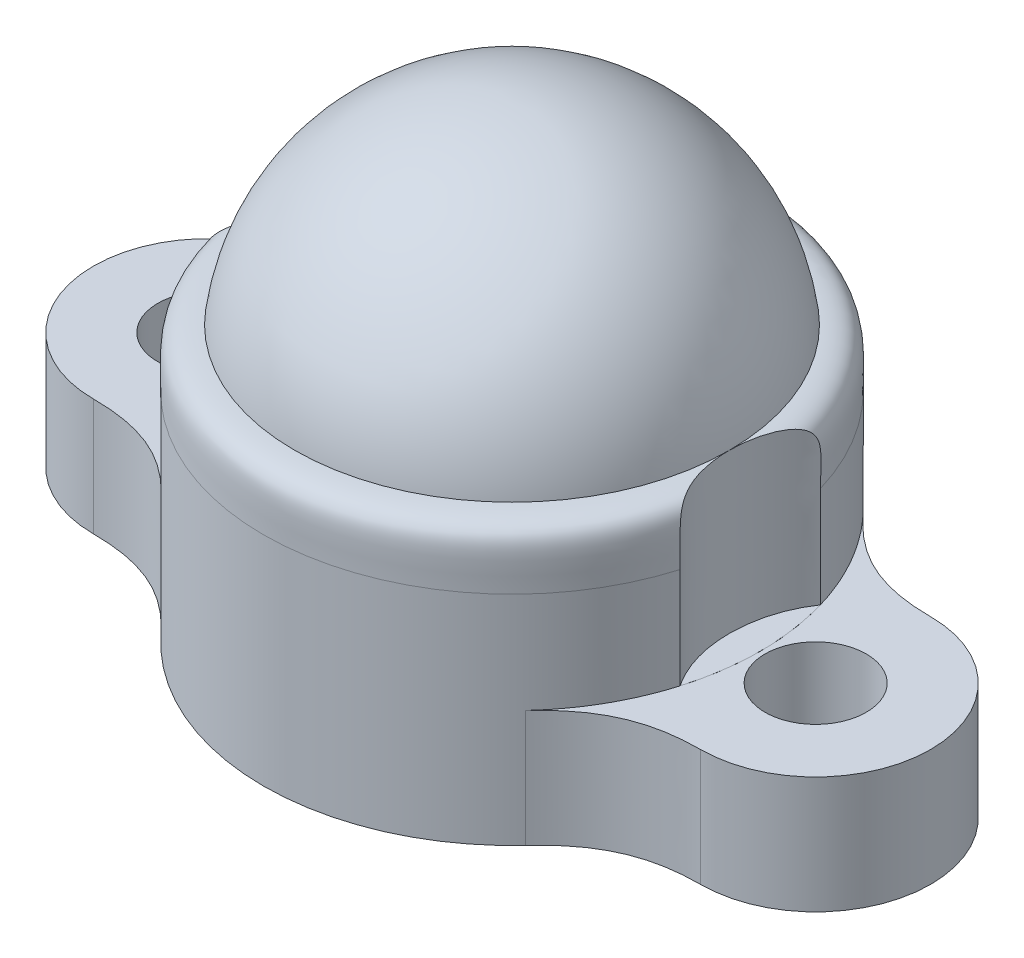
ISO-10303-21;
HEADER;
FILE_DESCRIPTION(('STEP AP214'),'2;1');
FILE_NAME('part.step','',(''),(''),'','','');
FILE_SCHEMA(('AUTOMOTIVE_DESIGN { 1 0 10303 214 1 1 1 1 }'));
ENDSEC;
DATA;
#1=APPLICATION_CONTEXT('core data for automotive mechanical design processes');
#2=APPLICATION_PROTOCOL_DEFINITION('international standard','automotive_design',2000,#1);
#3=PRODUCT_CONTEXT('',#1,'mechanical');
#4=PRODUCT('Part','Part','',(#3));
#5=PRODUCT_RELATED_PRODUCT_CATEGORY('part','',(#4));
#6=PRODUCT_DEFINITION_FORMATION('','',#4);
#7=PRODUCT_DEFINITION_CONTEXT('part definition',#1,'design');
#8=PRODUCT_DEFINITION('design','',#6,#7);
#9=PRODUCT_DEFINITION_SHAPE('','',#8);
#10=(LENGTH_UNIT() NAMED_UNIT(*) SI_UNIT(.MILLI.,.METRE.));
#11=(NAMED_UNIT(*) PLANE_ANGLE_UNIT() SI_UNIT($,.RADIAN.));
#12=(NAMED_UNIT(*) SI_UNIT($,.STERADIAN.) SOLID_ANGLE_UNIT());
#13=UNCERTAINTY_MEASURE_WITH_UNIT(LENGTH_MEASURE(1.E-05),#10,'distance_accuracy_value','');
#14=(GEOMETRIC_REPRESENTATION_CONTEXT(3) GLOBAL_UNCERTAINTY_ASSIGNED_CONTEXT((#13)) GLOBAL_UNIT_ASSIGNED_CONTEXT((#10,
#11,#12)) REPRESENTATION_CONTEXT('',''));
#15=CARTESIAN_POINT('',(0.,0.,0.));
#16=DIRECTION('',(0.,0.,1.));
#17=DIRECTION('',(1.,0.,0.));
#18=AXIS2_PLACEMENT_3D('',#15,#16,#17);
#19=CARTESIAN_POINT('',(6.6,-2.8575,-2.5));
#20=CARTESIAN_POINT('',(5.36231166563302,-2.8575,-2.5));
#21=CARTESIAN_POINT('',(4.63638579948082,-2.8575,-2.94110421368491));
#22=CARTESIAN_POINT('',(3.95984253467832,-2.8575,-3.67089941930334));
#23=B_SPLINE_CURVE_WITH_KNOTS('',3,(#19,#20,#21,#22),.UNSPECIFIED.,.F.,.F.,(4,4),(0.,1.),.UNSPECIFIED.);
#24=DIRECTION('',(0.,-1.,0.));
#25=VECTOR('',#24,1.);
#26=SURFACE_OF_LINEAR_EXTRUSION('',#23,#25);
#27=CARTESIAN_POINT('',(6.6,-5.3975,-2.5));
#28=CARTESIAN_POINT('',(5.36231166563302,-5.3975,-2.5));
#29=CARTESIAN_POINT('',(4.63638579948082,-5.3975,-2.94110421368491));
#30=CARTESIAN_POINT('',(3.95984253467832,-5.3975,-3.67089941930334));
#31=B_SPLINE_CURVE_WITH_KNOTS('',3,(#27,#28,#29,#30),.UNSPECIFIED.,.F.,.F.,(4,4),(0.,1.),.UNSPECIFIED.);
#32=CARTESIAN_POINT('',(6.6,-5.3975,-2.5));
#33=VERTEX_POINT('',#32);
#34=CARTESIAN_POINT('',(3.95984253467832,-5.3975,-3.67089941930334));
#35=VERTEX_POINT('',#34);
#36=EDGE_CURVE('E137',#33,#35,#31,.T.);
#37=ORIENTED_EDGE('',*,*,#36,.T.);
#38=DIRECTION('',(0.,-1.,0.));
#39=VECTOR('',#38,1.);
#40=CARTESIAN_POINT('',(3.95984253467832,-2.8575,-3.67089941930334));
#41=LINE('',#40,#39);
#42=CARTESIAN_POINT('',(3.95984253467832,-2.8575,-3.67089941930334));
#43=VERTEX_POINT('',#42);
#44=EDGE_CURVE('E12',#43,#35,#41,.T.);
#45=ORIENTED_EDGE('',*,*,#44,.F.);
#46=CARTESIAN_POINT('',(6.6,-2.8575,-2.5));
#47=VERTEX_POINT('',#46);
#48=EDGE_CURVE('E105',#47,#43,#23,.T.);
#49=ORIENTED_EDGE('',*,*,#48,.F.);
#50=DIRECTION('',(0.,-1.,0.));
#51=VECTOR('',#50,1.);
#52=CARTESIAN_POINT('',(6.6,-2.8575,-2.5));
#53=LINE('',#52,#51);
#54=EDGE_CURVE('E51',#47,#33,#53,.T.);
#55=ORIENTED_EDGE('',*,*,#54,.T.);
#56=EDGE_LOOP('',(#37,#45,#49,#55));
#57=FACE_BOUND('',#56,.T.);
#58=ADVANCED_FACE('F47',(#57),#26,.F.);
#59=CARTESIAN_POINT('',(0.,-2.8575,0.));
#60=DIRECTION('',(0.,-1.,0.));
#61=DIRECTION('',(0.,0.,-1.));
#62=AXIS2_PLACEMENT_3D('',#59,#60,#61);
#63=CYLINDRICAL_SURFACE('',#62,5.39961623137138);
#64=CARTESIAN_POINT('',(0.,-5.3975,0.));
#65=DIRECTION('',(0.,-1.,0.));
#66=DIRECTION('',(0.,0.,-1.));
#67=AXIS2_PLACEMENT_3D('',#64,#65,#66);
#68=CIRCLE('',#67,5.39961623137138);
#69=CARTESIAN_POINT('',(3.95984253467832,-5.3975,3.67089941930334));
#70=VERTEX_POINT('',#69);
#71=EDGE_CURVE('E87',#35,#70,#68,.T.);
#72=ORIENTED_EDGE('',*,*,#71,.T.);
#73=DIRECTION('',(0.,-1.,0.));
#74=VECTOR('',#73,1.);
#75=CARTESIAN_POINT('',(3.95984253467832,-2.8575,3.67089941930334));
#76=LINE('',#75,#74);
#77=CARTESIAN_POINT('',(3.95984253467832,-2.8575,3.67089941930334));
#78=VERTEX_POINT('',#77);
#79=EDGE_CURVE('E57',#78,#70,#76,.T.);
#80=ORIENTED_EDGE('',*,*,#79,.F.);
#81=CARTESIAN_POINT('',(0.,-2.8575,0.));
#82=DIRECTION('',(0.,-1.,0.));
#83=DIRECTION('',(0.,0.,-1.));
#84=AXIS2_PLACEMENT_3D('',#81,#82,#83);
#85=CIRCLE('',#84,5.39961623137138);
#86=EDGE_CURVE('E65',#43,#78,#85,.T.);
#87=ORIENTED_EDGE('',*,*,#86,.F.);
#88=ORIENTED_EDGE('',*,*,#44,.T.);
#89=EDGE_LOOP('',(#72,#80,#87,#88));
#90=FACE_BOUND('',#89,.T.);
#91=ADVANCED_FACE('F122',(#90),#63,.F.);
#92=CARTESIAN_POINT('',(6.6,-2.8575,2.5));
#93=CARTESIAN_POINT('',(5.36231166563302,-2.8575,2.5));
#94=CARTESIAN_POINT('',(4.63638579948082,-2.8575,2.94110421368491));
#95=CARTESIAN_POINT('',(3.95984253467832,-2.8575,3.67089941930334));
#96=B_SPLINE_CURVE_WITH_KNOTS('',3,(#92,#93,#94,#95),.UNSPECIFIED.,.F.,.F.,(4,4),(0.,1.),.UNSPECIFIED.);
#97=DIRECTION('',(0.,-1.,0.));
#98=VECTOR('',#97,1.);
#99=SURFACE_OF_LINEAR_EXTRUSION('',#96,#98);
#100=CARTESIAN_POINT('',(6.6,-5.3975,2.5));
#101=CARTESIAN_POINT('',(5.36231166563302,-5.3975,2.5));
#102=CARTESIAN_POINT('',(4.63638579948082,-5.3975,2.94110421368491));
#103=CARTESIAN_POINT('',(3.95984253467832,-5.3975,3.67089941930334));
#104=B_SPLINE_CURVE_WITH_KNOTS('',3,(#100,#101,#102,#103),.UNSPECIFIED.,.F.,.F.,(4,4),(0.,1.),.UNSPECIFIED.);
#105=CARTESIAN_POINT('',(6.6,-5.3975,2.5));
#106=VERTEX_POINT('',#105);
#107=EDGE_CURVE('E99',#106,#70,#104,.T.);
#108=ORIENTED_EDGE('',*,*,#107,.F.);
#109=DIRECTION('',(0.,-1.,0.));
#110=VECTOR('',#109,1.);
#111=CARTESIAN_POINT('',(6.6,-2.8575,2.5));
#112=LINE('',#111,#110);
#113=CARTESIAN_POINT('',(6.6,-2.8575,2.5));
#114=VERTEX_POINT('',#113);
#115=EDGE_CURVE('E96',#114,#106,#112,.T.);
#116=ORIENTED_EDGE('',*,*,#115,.F.);
#117=EDGE_CURVE('E98',#114,#78,#96,.T.);
#118=ORIENTED_EDGE('',*,*,#117,.T.);
#119=ORIENTED_EDGE('',*,*,#79,.T.);
#120=EDGE_LOOP('',(#108,#116,#118,#119));
#121=FACE_BOUND('',#120,.T.);
#122=ADVANCED_FACE('F97',(#121),#99,.T.);
#123=CARTESIAN_POINT('',(6.6,-2.8575,0.));
#124=DIRECTION('',(0.,-1.,0.));
#125=DIRECTION('',(0.,0.,-1.));
#126=AXIS2_PLACEMENT_3D('',#123,#124,#125);
#127=CYLINDRICAL_SURFACE('',#126,2.5);
#128=CARTESIAN_POINT('',(6.6,-5.3975,0.));
#129=DIRECTION('',(0.,-1.,0.));
#130=DIRECTION('',(0.,0.,-1.));
#131=AXIS2_PLACEMENT_3D('',#128,#129,#130);
#132=CIRCLE('',#131,2.5);
#133=EDGE_CURVE('E138',#106,#33,#132,.F.);
#134=ORIENTED_EDGE('',*,*,#133,.T.);
#135=ORIENTED_EDGE('',*,*,#54,.F.);
#136=CARTESIAN_POINT('',(6.6,-2.8575,0.));
#137=DIRECTION('',(0.,-1.,0.));
#138=DIRECTION('',(0.,0.,-1.));
#139=AXIS2_PLACEMENT_3D('',#136,#137,#138);
#140=CIRCLE('',#139,2.5);
#141=EDGE_CURVE('E93',#114,#47,#140,.F.);
#142=ORIENTED_EDGE('',*,*,#141,.F.);
#143=ORIENTED_EDGE('',*,*,#115,.T.);
#144=EDGE_LOOP('',(#134,#135,#142,#143));
#145=FACE_BOUND('',#144,.T.);
#146=ADVANCED_FACE('F102',(#145),#127,.T.);
#147=CARTESIAN_POINT('',(6.6,-2.8575,0.));
#148=DIRECTION('',(0.,-1.,0.));
#149=DIRECTION('',(0.,0.,-1.));
#150=AXIS2_PLACEMENT_3D('',#147,#148,#149);
#151=CYLINDRICAL_SURFACE('',#150,1.1);
#152=CARTESIAN_POINT('',(6.6,-2.8575,0.));
#153=DIRECTION('',(0.,-1.,0.));
#154=DIRECTION('',(0.,0.,-1.));
#155=AXIS2_PLACEMENT_3D('',#152,#153,#154);
#156=CIRCLE('',#155,1.1);
#157=CARTESIAN_POINT('',(6.6,-2.8575,-1.1));
#158=VERTEX_POINT('',#157);
#159=EDGE_CURVE('E110',#158,#158,#156,.T.);
#160=ORIENTED_EDGE('',*,*,#159,.F.);
#161=EDGE_LOOP('',(#160));
#162=FACE_BOUND('',#161,.T.);
#163=CARTESIAN_POINT('',(6.6,-5.3975,0.));
#164=DIRECTION('',(0.,-1.,0.));
#165=DIRECTION('',(0.,0.,-1.));
#166=AXIS2_PLACEMENT_3D('',#163,#164,#165);
#167=CIRCLE('',#166,1.1);
#168=CARTESIAN_POINT('',(6.6,-5.3975,-1.1));
#169=VERTEX_POINT('',#168);
#170=EDGE_CURVE('E154',#169,#169,#167,.T.);
#171=ORIENTED_EDGE('',*,*,#170,.T.);
#172=EDGE_LOOP('',(#171));
#173=FACE_BOUND('',#172,.T.);
#174=ADVANCED_FACE('F125',(#162,#173),#151,.F.);
#175=CARTESIAN_POINT('',(0.,-2.8575,0.));
#176=DIRECTION('',(0.,-1.,0.));
#177=DIRECTION('',(0.,0.,-1.));
#178=AXIS2_PLACEMENT_3D('',#175,#176,#177);
#179=PLANE('',#178);
#180=ORIENTED_EDGE('',*,*,#48,.T.);
#181=ORIENTED_EDGE('',*,*,#86,.T.);
#182=ORIENTED_EDGE('',*,*,#117,.F.);
#183=ORIENTED_EDGE('',*,*,#141,.T.);
#184=EDGE_LOOP('',(#180,#181,#182,#183));
#185=FACE_BOUND('',#184,.T.);
#186=ORIENTED_EDGE('',*,*,#159,.T.);
#187=EDGE_LOOP('',(#186));
#188=FACE_BOUND('',#187,.T.);
#189=ADVANCED_FACE('F107',(#185,#188),#179,.F.);
#190=CARTESIAN_POINT('',(0.,-5.3975,0.));
#191=DIRECTION('',(0.,-1.,0.));
#192=DIRECTION('',(0.,0.,-1.));
#193=AXIS2_PLACEMENT_3D('',#190,#191,#192);
#194=PLANE('',#193);
#195=ORIENTED_EDGE('',*,*,#36,.F.);
#196=ORIENTED_EDGE('',*,*,#133,.F.);
#197=ORIENTED_EDGE('',*,*,#107,.T.);
#198=ORIENTED_EDGE('',*,*,#71,.F.);
#199=EDGE_LOOP('',(#195,#196,#197,#198));
#200=FACE_BOUND('',#199,.T.);
#201=ORIENTED_EDGE('',*,*,#170,.F.);
#202=EDGE_LOOP('',(#201));
#203=FACE_BOUND('',#202,.T.);
#204=ADVANCED_FACE('F166',(#200,#203),#194,.T.);
#205=CLOSED_SHELL('',(#58,#91,#122,#146,#174,#189,#204));
#206=MANIFOLD_SOLID_BREP('B2',#205);
#207=CARTESIAN_POINT('',(0.,-2.8575,0.));
#208=DIRECTION('',(0.,-1.,0.));
#209=DIRECTION('',(0.,0.,-1.));
#210=AXIS2_PLACEMENT_3D('',#207,#208,#209);
#211=CYLINDRICAL_SURFACE('',#210,5.39961623137138);
#212=CARTESIAN_POINT('',(0.,-5.3975,0.));
#213=DIRECTION('',(0.,-1.,0.));
#214=DIRECTION('',(0.,0.,-1.));
#215=AXIS2_PLACEMENT_3D('',#212,#213,#214);
#216=CIRCLE('',#215,5.39961623137138);
#217=CARTESIAN_POINT('',(-3.95984253467833,-5.3975,3.67089941930334));
#218=VERTEX_POINT('',#217);
#219=CARTESIAN_POINT('',(-3.95984253467832,-5.3975,-3.67089941930334));
#220=VERTEX_POINT('',#219);
#221=EDGE_CURVE('E338',#218,#220,#216,.T.);
#222=ORIENTED_EDGE('',*,*,#221,.T.);
#223=DIRECTION('',(0.,-1.,0.));
#224=VECTOR('',#223,1.);
#225=CARTESIAN_POINT('',(-3.95984253467832,-2.8575,-3.67089941930334));
#226=LINE('',#225,#224);
#227=CARTESIAN_POINT('',(-3.95984253467832,-2.8575,-3.67089941930334));
#228=VERTEX_POINT('',#227);
#229=EDGE_CURVE('E45',#228,#220,#226,.T.);
#230=ORIENTED_EDGE('',*,*,#229,.F.);
#231=CARTESIAN_POINT('',(0.,-2.8575,0.));
#232=DIRECTION('',(0.,-1.,0.));
#233=DIRECTION('',(0.,0.,-1.));
#234=AXIS2_PLACEMENT_3D('',#231,#232,#233);
#235=CIRCLE('',#234,5.39961623137138);
#236=CARTESIAN_POINT('',(-3.95984253467833,-2.8575,3.67089941930334));
#237=VERTEX_POINT('',#236);
#238=EDGE_CURVE('E268',#237,#228,#235,.T.);
#239=ORIENTED_EDGE('',*,*,#238,.F.);
#240=DIRECTION('',(0.,-1.,0.));
#241=VECTOR('',#240,1.);
#242=CARTESIAN_POINT('',(-3.95984253467833,-2.8575,3.67089941930334));
#243=LINE('',#242,#241);
#244=EDGE_CURVE('E253',#237,#218,#243,.T.);
#245=ORIENTED_EDGE('',*,*,#244,.T.);
#246=EDGE_LOOP('',(#222,#230,#239,#245));
#247=FACE_BOUND('',#246,.T.);
#248=ADVANCED_FACE('F249',(#247),#211,.F.);
#249=CARTESIAN_POINT('',(-6.6,-2.8575,-2.5));
#250=CARTESIAN_POINT('',(-5.36231166563302,-2.8575,-2.5));
#251=CARTESIAN_POINT('',(-4.63638579948082,-2.8575,-2.94110421368491));
#252=CARTESIAN_POINT('',(-3.95984253467832,-2.8575,-3.67089941930334));
#253=B_SPLINE_CURVE_WITH_KNOTS('',3,(#249,#250,#251,#252),.UNSPECIFIED.,.F.,.F.,(4,4),(0.,1.),.UNSPECIFIED.);
#254=DIRECTION('',(0.,-1.,0.));
#255=VECTOR('',#254,1.);
#256=SURFACE_OF_LINEAR_EXTRUSION('',#253,#255);
#257=CARTESIAN_POINT('',(-6.6,-5.3975,-2.5));
#258=CARTESIAN_POINT('',(-5.36231166563302,-5.3975,-2.5));
#259=CARTESIAN_POINT('',(-4.63638579948082,-5.3975,-2.94110421368491));
#260=CARTESIAN_POINT('',(-3.95984253467832,-5.3975,-3.67089941930334));
#261=B_SPLINE_CURVE_WITH_KNOTS('',3,(#257,#258,#259,#260),.UNSPECIFIED.,.F.,.F.,(4,4),(0.,1.),.UNSPECIFIED.);
#262=CARTESIAN_POINT('',(-6.6,-5.3975,-2.5));
#263=VERTEX_POINT('',#262);
#264=EDGE_CURVE('E342',#263,#220,#261,.T.);
#265=ORIENTED_EDGE('',*,*,#264,.F.);
#266=DIRECTION('',(0.,-1.,0.));
#267=VECTOR('',#266,1.);
#268=CARTESIAN_POINT('',(-6.6,-2.8575,-2.5));
#269=LINE('',#268,#267);
#270=CARTESIAN_POINT('',(-6.6,-2.8575,-2.5));
#271=VERTEX_POINT('',#270);
#272=EDGE_CURVE('E259',#271,#263,#269,.T.);
#273=ORIENTED_EDGE('',*,*,#272,.F.);
#274=EDGE_CURVE('E307',#271,#228,#253,.T.);
#275=ORIENTED_EDGE('',*,*,#274,.T.);
#276=ORIENTED_EDGE('',*,*,#229,.T.);
#277=EDGE_LOOP('',(#265,#273,#275,#276));
#278=FACE_BOUND('',#277,.T.);
#279=ADVANCED_FACE('F324',(#278),#256,.T.);
#280=CARTESIAN_POINT('',(-6.6,-2.8575,0.));
#281=DIRECTION('',(0.,-1.,0.));
#282=DIRECTION('',(0.,0.,-1.));
#283=AXIS2_PLACEMENT_3D('',#280,#281,#282);
#284=CYLINDRICAL_SURFACE('',#283,2.5);
#285=CARTESIAN_POINT('',(-6.6,-5.3975,0.));
#286=DIRECTION('',(0.,-1.,0.));
#287=DIRECTION('',(0.,0.,-1.));
#288=AXIS2_PLACEMENT_3D('',#285,#286,#287);
#289=CIRCLE('',#288,2.5);
#290=CARTESIAN_POINT('',(-6.6,-5.3975,2.5));
#291=VERTEX_POINT('',#290);
#292=EDGE_CURVE('E300',#291,#263,#289,.T.);
#293=ORIENTED_EDGE('',*,*,#292,.F.);
#294=DIRECTION('',(0.,-1.,0.));
#295=VECTOR('',#294,1.);
#296=CARTESIAN_POINT('',(-6.6,-2.8575,2.5));
#297=LINE('',#296,#295);
#298=CARTESIAN_POINT('',(-6.6,-2.8575,2.5));
#299=VERTEX_POINT('',#298);
#300=EDGE_CURVE('E297',#299,#291,#297,.T.);
#301=ORIENTED_EDGE('',*,*,#300,.F.);
#302=CARTESIAN_POINT('',(-6.6,-2.8575,0.));
#303=DIRECTION('',(0.,-1.,0.));
#304=DIRECTION('',(0.,0.,-1.));
#305=AXIS2_PLACEMENT_3D('',#302,#303,#304);
#306=CIRCLE('',#305,2.5);
#307=EDGE_CURVE('E299',#299,#271,#306,.T.);
#308=ORIENTED_EDGE('',*,*,#307,.T.);
#309=ORIENTED_EDGE('',*,*,#272,.T.);
#310=EDGE_LOOP('',(#293,#301,#308,#309));
#311=FACE_BOUND('',#310,.T.);
#312=ADVANCED_FACE('F298',(#311),#284,.T.);
#313=CARTESIAN_POINT('',(-6.6,-2.8575,0.));
#314=DIRECTION('',(0.,-1.,0.));
#315=DIRECTION('',(0.,0.,-1.));
#316=AXIS2_PLACEMENT_3D('',#313,#314,#315);
#317=CYLINDRICAL_SURFACE('',#316,1.1);
#318=CARTESIAN_POINT('',(-6.6,-2.8575,0.));
#319=DIRECTION('',(0.,-1.,0.));
#320=DIRECTION('',(0.,0.,-1.));
#321=AXIS2_PLACEMENT_3D('',#318,#319,#320);
#322=CIRCLE('',#321,1.1);
#323=CARTESIAN_POINT('',(-6.6,-2.8575,-1.1));
#324=VERTEX_POINT('',#323);
#325=EDGE_CURVE('E343',#324,#324,#322,.T.);
#326=ORIENTED_EDGE('',*,*,#325,.F.);
#327=EDGE_LOOP('',(#326));
#328=FACE_BOUND('',#327,.T.);
#329=CARTESIAN_POINT('',(-6.6,-5.3975,0.));
#330=DIRECTION('',(0.,-1.,0.));
#331=DIRECTION('',(0.,0.,-1.));
#332=AXIS2_PLACEMENT_3D('',#329,#330,#331);
#333=CIRCLE('',#332,1.1);
#334=CARTESIAN_POINT('',(-6.6,-5.3975,-1.1));
#335=VERTEX_POINT('',#334);
#336=EDGE_CURVE('E318',#335,#335,#333,.T.);
#337=ORIENTED_EDGE('',*,*,#336,.T.);
#338=EDGE_LOOP('',(#337));
#339=FACE_BOUND('',#338,.T.);
#340=ADVANCED_FACE('F251',(#328,#339),#317,.F.);
#341=CARTESIAN_POINT('',(-6.6,-2.8575,2.5));
#342=CARTESIAN_POINT('',(-5.36231166563302,-2.8575,2.5));
#343=CARTESIAN_POINT('',(-4.63638579948082,-2.8575,2.94110421368491));
#344=CARTESIAN_POINT('',(-3.95984253467832,-2.8575,3.67089941930334));
#345=B_SPLINE_CURVE_WITH_KNOTS('',3,(#341,#342,#343,#344),.UNSPECIFIED.,.F.,.F.,(4,4),(0.,1.),.UNSPECIFIED.);
#346=DIRECTION('',(0.,-1.,0.));
#347=VECTOR('',#346,1.);
#348=SURFACE_OF_LINEAR_EXTRUSION('',#345,#347);
#349=CARTESIAN_POINT('',(-6.6,-5.3975,2.5));
#350=CARTESIAN_POINT('',(-5.36231166563302,-5.3975,2.5));
#351=CARTESIAN_POINT('',(-4.63638579948082,-5.3975,2.94110421368491));
#352=CARTESIAN_POINT('',(-3.95984253467832,-5.3975,3.67089941930334));
#353=B_SPLINE_CURVE_WITH_KNOTS('',3,(#349,#350,#351,#352),.UNSPECIFIED.,.F.,.F.,(4,4),(0.,1.),.UNSPECIFIED.);
#354=EDGE_CURVE('E341',#291,#218,#353,.T.);
#355=ORIENTED_EDGE('',*,*,#354,.T.);
#356=ORIENTED_EDGE('',*,*,#244,.F.);
#357=EDGE_CURVE('E294',#299,#237,#345,.T.);
#358=ORIENTED_EDGE('',*,*,#357,.F.);
#359=ORIENTED_EDGE('',*,*,#300,.T.);
#360=EDGE_LOOP('',(#355,#356,#358,#359));
#361=FACE_BOUND('',#360,.T.);
#362=ADVANCED_FACE('F303',(#361),#348,.F.);
#363=CARTESIAN_POINT('',(0.,-2.8575,0.));
#364=DIRECTION('',(0.,-1.,0.));
#365=DIRECTION('',(0.,0.,-1.));
#366=AXIS2_PLACEMENT_3D('',#363,#364,#365);
#367=PLANE('',#366);
#368=ORIENTED_EDGE('',*,*,#325,.T.);
#369=EDGE_LOOP('',(#368));
#370=FACE_BOUND('',#369,.T.);
#371=ORIENTED_EDGE('',*,*,#238,.T.);
#372=ORIENTED_EDGE('',*,*,#274,.F.);
#373=ORIENTED_EDGE('',*,*,#307,.F.);
#374=ORIENTED_EDGE('',*,*,#357,.T.);
#375=EDGE_LOOP('',(#371,#372,#373,#374));
#376=FACE_BOUND('',#375,.T.);
#377=ADVANCED_FACE('F306',(#370,#376),#367,.F.);
#378=CARTESIAN_POINT('',(0.,-5.3975,0.));
#379=DIRECTION('',(0.,-1.,0.));
#380=DIRECTION('',(0.,0.,-1.));
#381=AXIS2_PLACEMENT_3D('',#378,#379,#380);
#382=PLANE('',#381);
#383=ORIENTED_EDGE('',*,*,#336,.F.);
#384=EDGE_LOOP('',(#383));
#385=FACE_BOUND('',#384,.T.);
#386=ORIENTED_EDGE('',*,*,#221,.F.);
#387=ORIENTED_EDGE('',*,*,#354,.F.);
#388=ORIENTED_EDGE('',*,*,#292,.T.);
#389=ORIENTED_EDGE('',*,*,#264,.T.);
#390=EDGE_LOOP('',(#386,#387,#388,#389));
#391=FACE_BOUND('',#390,.T.);
#392=ADVANCED_FACE('F328',(#385,#391),#382,.T.);
#393=CLOSED_SHELL('',(#248,#279,#312,#340,#362,#377,#392));
#394=MANIFOLD_SOLID_BREP('B6',#393);
#395=CARTESIAN_POINT('',(-4.72596088787566,0.588812309882797,0.));
#396=CARTESIAN_POINT('',(-5.52867938476816,0.558813227657162,0.));
#397=CARTESIAN_POINT('',(-5.39961623137138,0.190451495914761,0.));
#398=CARTESIAN_POINT('',(-5.39961623137138,-0.666596713895308,0.));
#399=B_SPLINE_CURVE_WITH_KNOTS('',3,(#395,#396,#397,#398),.UNSPECIFIED.,.F.,.F.,(4,4),(0.,1.),.UNSPECIFIED.);
#400=CARTESIAN_POINT('',(0.,8.57491052322613,0.));
#401=DIRECTION('',(0.,1.,0.));
#402=AXIS1_PLACEMENT('',#400,#401);
#403=SURFACE_OF_REVOLUTION('',#399,#402);
#404=CARTESIAN_POINT('',(0.,-0.666596713895308,0.));
#405=DIRECTION('',(0.,1.,0.));
#406=DIRECTION('',(0.,0.,1.));
#407=AXIS2_PLACEMENT_3D('',#404,#405,#406);
#408=CIRCLE('',#407,5.39961623137138);
#409=CARTESIAN_POINT('',(-5.17988336877937,-0.666596713895308,1.52468479756707));
#410=VERTEX_POINT('',#409);
#411=CARTESIAN_POINT('',(5.17988336877937,-0.666596713895308,1.52468479756707));
#412=VERTEX_POINT('',#411);
#413=EDGE_CURVE('E543',#410,#412,#408,.T.);
#414=ORIENTED_EDGE('',*,*,#413,.T.);
#415=CARTESIAN_POINT('',(5.17988336877937,-0.666596713895308,1.52468479756707));
#416=CARTESIAN_POINT('',(5.17987478112245,-0.627249245943654,1.52467225212427));
#417=CARTESIAN_POINT('',(5.18008128603715,-0.58790523564545,1.52497147573817));
#418=CARTESIAN_POINT('',(5.18078352169532,-0.509062343068171,1.52598743904063));
#419=CARTESIAN_POINT('',(5.18128044175042,-0.469563491268711,1.52670589555792));
#420=CARTESIAN_POINT('',(5.182421462096,-0.390490911940575,1.52835269330812));
#421=CARTESIAN_POINT('',(5.18306586867935,-0.350917200990727,1.52928147128337));
#422=CARTESIAN_POINT('',(5.1843056319824,-0.26937293725303,1.53106556801329));
#423=CARTESIAN_POINT('',(5.18489567436371,-0.227402002007771,1.53191306028853));
#424=CARTESIAN_POINT('',(5.18555064467382,-0.143523595380704,1.53285297185438));
#425=CARTESIAN_POINT('',(5.18561653173989,-0.101616148443009,1.53294677031157));
#426=CARTESIAN_POINT('',(5.18452884768195,-0.0178843219547039,1.53138725542123));
#427=CARTESIAN_POINT('',(5.18337763653264,0.0239400613834072,1.52973732320019));
#428=CARTESIAN_POINT('',(5.18020570472958,0.0796141761268866,1.52515199304403));
#429=CARTESIAN_POINT('',(5.17926582245026,0.093645692658301,1.52379167800645));
#430=CARTESIAN_POINT('',(5.17703620262478,0.121622205090491,1.52055370230315));
#431=CARTESIAN_POINT('',(5.17574637743758,0.135567178420954,1.51867591203707));
#432=CARTESIAN_POINT('',(5.1712556154166,0.177055849254392,1.51211366292583));
#433=CARTESIAN_POINT('',(5.16742604064735,0.204412170351379,1.50648989715596));
#434=CARTESIAN_POINT('',(5.1584153586952,0.252458515218971,1.49305496062752));
#435=CARTESIAN_POINT('',(5.15364957031177,0.27339948791284,1.48589364630521));
#436=CARTESIAN_POINT('',(5.14238591488567,0.313546779208549,1.46868226198005));
#437=CARTESIAN_POINT('',(5.13589212935382,0.332757044429965,1.4586389947944));
#438=CARTESIAN_POINT('',(5.12124246248743,0.368702907388466,1.43547866940618));
#439=CARTESIAN_POINT('',(5.11307698883452,0.385423215427462,1.42234380307151));
#440=CARTESIAN_POINT('',(5.09561575909724,0.415795804042656,1.39350635960746));
#441=CARTESIAN_POINT('',(5.08631774514221,0.429441796062285,1.37779863092155));
#442=CARTESIAN_POINT('',(5.06354933716841,0.458500291339637,1.33818336821142));
#443=CARTESIAN_POINT('',(5.04984951948708,0.472573900408496,1.31344555074435));
#444=CARTESIAN_POINT('',(5.02256904442812,0.496552398925397,1.26195104634732));
#445=CARTESIAN_POINT('',(5.00898907112446,0.506440609136238,1.23518677374721));
#446=CARTESIAN_POINT('',(4.97702307961114,0.526827971259419,1.16917626779827));
#447=CARTESIAN_POINT('',(4.95896941185262,0.535891730341172,1.12934152807249));
#448=CARTESIAN_POINT('',(4.92471207467144,0.550643989354994,1.04824670041338));
#449=CARTESIAN_POINT('',(4.90851246944578,0.556325184830765,1.00698373000494));
#450=CARTESIAN_POINT('',(4.87810654259131,0.565602164302705,0.923401494330118));
#451=CARTESIAN_POINT('',(4.86390484123144,0.569193172841835,0.881080038837916));
#452=CARTESIAN_POINT('',(4.83758211933784,0.575039904256557,0.795699797690799));
#453=CARTESIAN_POINT('',(4.82546181194927,0.577295170114051,0.75264076485592));
#454=CARTESIAN_POINT('',(4.79515408139251,0.582310612968943,0.634021093187502));
#455=CARTESIAN_POINT('',(4.77907222382745,0.584219435463312,0.557878450919556));
#456=CARTESIAN_POINT('',(4.75321822576222,0.586876018331807,0.404706817447741));
#457=CARTESIAN_POINT('',(4.74343198741343,0.587626378180282,0.3276802025338));
#458=CARTESIAN_POINT('',(4.73006623922062,0.588578707431598,0.173046281114082));
#459=CARTESIAN_POINT('',(4.72648993902946,0.588780393278686,0.0954386951275426));
#460=CARTESIAN_POINT('',(4.72554061686464,0.588837652033926,-0.059833923148627));
#461=CARTESIAN_POINT('',(4.72816915502655,0.588693137893918,-0.137498964976509));
#462=CARTESIAN_POINT('',(4.73963510290512,0.587909335444045,-0.292270057146084));
#463=CARTESIAN_POINT('',(4.74846490572885,0.58727065321685,-0.369376675533052));
#464=CARTESIAN_POINT('',(4.77237868515391,0.584968674270312,-0.522714175577087));
#465=CARTESIAN_POINT('',(4.78747019100913,0.583304142866591,-0.598943889023504));
#466=CARTESIAN_POINT('',(4.8153255255978,0.579033914052636,-0.714170498225114));
#467=CARTESIAN_POINT('',(4.82582487086312,0.577243488969713,-0.753755606481785));
#468=CARTESIAN_POINT('',(4.84857222870687,0.572702345812617,-0.832361366924595));
#469=CARTESIAN_POINT('',(4.86081983496807,0.569951850656373,-0.871382147952996));
#470=CARTESIAN_POINT('',(4.88701848473948,0.563012843921675,-0.948634107071389));
#471=CARTESIAN_POINT('',(4.90096605061311,0.558827237379098,-0.986866716148097));
#472=CARTESIAN_POINT('',(4.93051040898861,0.548250703476186,-1.06236311763328));
#473=CARTESIAN_POINT('',(4.94610555620188,0.541861962012825,-1.09962783110417));
#474=CARTESIAN_POINT('',(4.9743168177168,0.527774648794798,-1.16284248244423));
#475=CARTESIAN_POINT('',(4.98659501639688,0.52090015842679,-1.18912211219002));
#476=CARTESIAN_POINT('',(5.01172315969598,0.504465041707971,-1.24059649546297));
#477=CARTESIAN_POINT('',(5.02457319441994,0.494903990762058,-1.26579107677814));
#478=CARTESIAN_POINT('',(5.04850012577217,0.473653091008908,-1.3108447329197));
#479=CARTESIAN_POINT('',(5.05956246194914,0.46247667341528,-1.3309462261236));
#480=CARTESIAN_POINT('',(5.08118367811286,0.436585620465858,-1.36902962128636));
#481=CARTESIAN_POINT('',(5.09174386788847,0.421880872505681,-1.38701724070959));
#482=CARTESIAN_POINT('',(5.10986473717322,0.391403974798671,-1.41709685032091));
#483=CARTESIAN_POINT('',(5.11763040223411,0.376235580647181,-1.42967134877709));
#484=CARTESIAN_POINT('',(5.13180009488951,0.343548541328479,-1.4522256194112));
#485=CARTESIAN_POINT('',(5.13820531516656,0.32603197693142,-1.46220766607949));
#486=CARTESIAN_POINT('',(5.15102193098614,0.284330797067042,-1.48193638352346));
#487=CARTESIAN_POINT('',(5.15696236750101,0.259627394640444,-1.49088254849616));
#488=CARTESIAN_POINT('',(5.16425625857439,0.221555453877432,-1.50176613995693));
#489=CARTESIAN_POINT('',(5.16642190000873,0.208657475198557,-1.50497683762908));
#490=CARTESIAN_POINT('',(5.17028510347371,0.182635537978806,-1.51067960300751));
#491=CARTESIAN_POINT('',(5.17198279743682,0.169511644243056,-1.51317187327531));
#492=CARTESIAN_POINT('',(5.1759753763741,0.13437545358614,-1.51901523356771));
#493=CARTESIAN_POINT('',(5.17792008315656,0.112238292860946,-1.52184040013437));
#494=CARTESIAN_POINT('',(5.18100904098972,0.0677846748378274,-1.52631588322749));
#495=CARTESIAN_POINT('',(5.18215260042568,0.0454680794040822,-1.52796518467434));
#496=CARTESIAN_POINT('',(5.18474835149827,-0.0216919588554476,-1.53170532876736));
#497=CARTESIAN_POINT('',(5.185355086634,-0.0666277378430527,-1.53257320628925));
#498=CARTESIAN_POINT('',(5.18555965739196,-0.15668192632301,-1.53286504170395));
#499=CARTESIAN_POINT('',(5.18515273306648,-0.201800200431662,-1.53228218725193));
#500=CARTESIAN_POINT('',(5.18400485418906,-0.292033776810208,-1.53063309579433));
#501=CARTESIAN_POINT('',(5.18326382930027,-0.337149076452596,-1.52956675700249));
#502=CARTESIAN_POINT('',(5.18183432651756,-0.429838933111023,-1.52750592944184));
#503=CARTESIAN_POINT('',(5.18115090088536,-0.477413747597511,-1.52651850604675));
#504=CARTESIAN_POINT('',(5.1801672945251,-0.572188574101836,-1.5250962094534));
#505=CARTESIAN_POINT('',(5.17986405109433,-0.619388497166014,-1.52465692068562));
#506=CARTESIAN_POINT('',(5.17988336877937,-0.666596713895308,-1.52468479756707));
#507=B_SPLINE_CURVE_WITH_KNOTS('',3,(#415,#416,#417,#418,#419,#420,#421,#422,#423,#424,#425,
#426,#427,#428,#429,#430,#431,#432,#433,#434,#435,#436,#437,#438,#439,#440,#441,#442,#443,#444,
#445,#446,#447,#448,#449,#450,#451,#452,#453,#454,#455,#456,#457,#458,#459,#460,#461,#462,#463,
#464,#465,#466,#467,#468,#469,#470,#471,#472,#473,#474,#475,#476,#477,#478,#479,#480,#481,#482,
#483,#484,#485,#486,#487,#488,#489,#490,#491,#492,#493,#494,#495,#496,#497,#498,#499,#500,#501,
#502,#503,#504,#505,#506),.UNSPECIFIED.,.F.,.F.,(4,2,2,2,2,2,2,2,2,2,2,2,2,2,2,2,2,2,2,2,2,2,2,
2,2,2,2,2,2,2,2,2,2,2,2,2,2,2,2,2,2,2,2,2,2,4),(0.,0.118035742477219,0.23655828751763,
0.35532924453439,0.481274742593783,0.606989723347643,0.73246138686034,0.774833508974015,
0.817216252738061,0.901505354631141,0.969176394601604,1.03668899364625,1.10460042810283,
1.17264953995064,1.26686892170592,1.36146032056742,1.49513160400046,1.62909050588555,
1.76335427481332,1.89766395496291,2.13088759506505,2.36358714007651,2.59640692182355,
2.82928524967447,3.06187841095076,3.294752063261,3.41768979514856,3.54059900118626,
3.66326086195556,3.78580136910267,3.87513540632937,3.96448357022415,4.04080827735574,
4.11692154857831,4.18012909482211,4.2432809970758,4.32358759528409,4.36396952063502,
4.40434004908899,4.47147287398766,4.53866358215641,4.67340148606235,4.80877328455385,
4.94417359563935,5.08694044189533,5.22854962668618),.UNSPECIFIED.);
#508=CARTESIAN_POINT('',(4.72596088787566,0.588812309882832,0.));
#509=VERTEX_POINT('',#508);
#510=EDGE_CURVE('E500',#412,#509,#507,.T.);
#511=ORIENTED_EDGE('',*,*,#510,.T.);
#512=CARTESIAN_POINT('',(0.,0.588812309882798,0.));
#513=DIRECTION('',(0.,1.,0.));
#514=DIRECTION('',(0.,0.,1.));
#515=AXIS2_PLACEMENT_3D('',#512,#513,#514);
#516=CIRCLE('',#515,4.72596088787566);
#517=CARTESIAN_POINT('',(-4.72596088787566,0.588812309882797,0.));
#518=VERTEX_POINT('',#517);
#519=EDGE_CURVE('E553',#518,#509,#516,.T.);
#520=ORIENTED_EDGE('',*,*,#519,.F.);
#521=CARTESIAN_POINT('',(-4.72596088787566,0.588812309882797,0.));
#522=CARTESIAN_POINT('',(-4.72596120481405,0.588807941469952,0.0396612250124431));
#523=CARTESIAN_POINT('',(-4.72677076814191,0.588763189711194,0.0793226875262591));
#524=CARTESIAN_POINT('',(-4.73001164348604,0.588561965775195,0.158603465136159));
#525=CARTESIAN_POINT('',(-4.73244395517445,0.588405424727492,0.198222739164489));
#526=CARTESIAN_POINT('',(-4.73893445400113,0.587949536843396,0.277337985715956));
#527=CARTESIAN_POINT('',(-4.74299307441946,0.587650151946588,0.316833922551437));
#528=CARTESIAN_POINT('',(-4.75276945592154,0.586839832237606,0.395857968558416));
#529=CARTESIAN_POINT('',(-4.75849700900009,0.586327641065277,0.435384853497661));
#530=CARTESIAN_POINT('',(-4.77160601783947,0.584992174645234,0.514150537513976));
#531=CARTESIAN_POINT('',(-4.77898708333131,0.58416897277216,0.553389402317473));
#532=CARTESIAN_POINT('',(-4.79540443263167,0.582054645456105,0.631489315087689));
#533=CARTESIAN_POINT('',(-4.80444019276899,0.580763667926771,0.670350478501874));
#534=CARTESIAN_POINT('',(-4.83119957708598,0.576363115274964,0.775122945766376));
#535=CARTESIAN_POINT('',(-4.85053188839684,0.572613136092251,0.840617577903461));
#536=CARTESIAN_POINT('',(-4.88311693738733,0.564073953326303,0.937320015775566));
#537=CARTESIAN_POINT('',(-4.89456617378459,0.560745544555379,0.969273521506228));
#538=CARTESIAN_POINT('',(-4.91862593274726,0.552673680761644,1.03255480852248));
#539=CARTESIAN_POINT('',(-4.93123596786505,0.547930817845509,1.06388284579296));
#540=CARTESIAN_POINT('',(-4.9578392648458,0.536257880339209,1.12642839267467));
#541=CARTESIAN_POINT('',(-4.97185783953733,0.529279592574178,1.15762645801693));
#542=CARTESIAN_POINT('',(-5.00080344848394,0.512085245771206,1.2187350651274));
#543=CARTESIAN_POINT('',(-5.0157300624379,0.501870675624767,1.24864619179447));
#544=CARTESIAN_POINT('',(-5.04183534037026,0.479938500629429,1.29850249014028));
#545=CARTESIAN_POINT('',(-5.05294582733847,0.469358243705168,1.31896943272139));
#546=CARTESIAN_POINT('',(-5.07479991397128,0.444781702923129,1.35795879921072));
#547=CARTESIAN_POINT('',(-5.08554438834913,0.430794326390219,1.37648611621718));
#548=CARTESIAN_POINT('',(-5.10408760081129,0.401731518632597,1.40760758395252));
#549=CARTESIAN_POINT('',(-5.11207142997718,0.387284697145449,1.42067168700207));
#550=CARTESIAN_POINT('',(-5.12678267658899,0.355940582348554,1.44431101276023));
#551=CARTESIAN_POINT('',(-5.13351122071788,0.339045510909558,1.45488846960203));
#552=CARTESIAN_POINT('',(-5.14544057720854,0.30351293647323,1.47338931280011));
#553=CARTESIAN_POINT('',(-5.15064889596522,0.284884615075765,1.4813257678008));
#554=CARTESIAN_POINT('',(-5.15965486941732,0.246489908777199,1.49491940531544));
#555=CARTESIAN_POINT('',(-5.16345033822822,0.226721814596599,1.50057305713565));
#556=CARTESIAN_POINT('',(-5.17121799578082,0.178118912623993,1.51207285794785));
#557=CARTESIAN_POINT('',(-5.17458845905478,0.148979312212221,1.51699282726237));
#558=CARTESIAN_POINT('',(-5.17971541030551,0.0902364489861829,1.5244484411432));
#559=CARTESIAN_POINT('',(-5.18146763815549,0.0606321698068429,1.52697779263479));
#560=CARTESIAN_POINT('',(-5.18394943293345,0.000982716086364506,1.53055460323098));
#561=CARTESIAN_POINT('',(-5.18466770500861,-0.0290637584642384,1.53158569661074));
#562=CARTESIAN_POINT('',(-5.18546123637948,-0.0891844380725289,1.53272473289379));
#563=CARTESIAN_POINT('',(-5.18553627668558,-0.119258649088412,1.53283236140154));
#564=CARTESIAN_POINT('',(-5.18532837601061,-0.178547857944224,1.53253401913048));
#565=CARTESIAN_POINT('',(-5.18505552774459,-0.20776303297162,1.53214252849577));
#566=CARTESIAN_POINT('',(-5.18434861353052,-0.266195425631529,1.53112698268772));
#567=CARTESIAN_POINT('',(-5.18391449850736,-0.295412641176235,1.53050285672089));
#568=CARTESIAN_POINT('',(-5.18301384920309,-0.353850289167096,1.52920637780247));
#569=CARTESIAN_POINT('',(-5.18254730952029,-0.383070721335678,1.52853401681468));
#570=CARTESIAN_POINT('',(-5.18168997989231,-0.440547637727327,1.52729714177465));
#571=CARTESIAN_POINT('',(-5.18129719434176,-0.468804026653553,1.52672979543246));
#572=CARTESIAN_POINT('',(-5.18063297706971,-0.525317333983845,1.52576972248361));
#573=CARTESIAN_POINT('',(-5.18036152729386,-0.553574251683076,1.52537696989803));
#574=CARTESIAN_POINT('',(-5.17998573222419,-0.610086042051724,1.52483303809633));
#575=CARTESIAN_POINT('',(-5.17988135536167,-0.638340914098512,1.52468181324315));
#576=CARTESIAN_POINT('',(-5.17988336877937,-0.666596713895308,1.52468479756707));
#577=B_SPLINE_CURVE_WITH_KNOTS('',3,(#521,#522,#523,#524,#525,#526,#527,#528,#529,#530,#531,
#532,#533,#534,#535,#536,#537,#538,#539,#540,#541,#542,#543,#544,#545,#546,#547,#548,#549,#550,
#551,#552,#553,#554,#555,#556,#557,#558,#559,#560,#561,#562,#563,#564,#565,#566,#567,#568,#569,
#570,#571,#572,#573,#574,#575,#576),.UNSPECIFIED.,.F.,.F.,(4,2,2,2,2,2,2,2,2,2,2,2,2,2,2,2,2,2,
2,2,2,2,2,2,2,2,2,4),(0.,0.118975767486407,0.238024896142063,0.35710576289428,0.476899877154708,
0.596665746835157,0.716393778785009,0.921266209467872,1.02354476249619,1.12578056050755,
1.23038940687798,1.33495019637572,1.411475460576,1.48780277036397,1.55064780168222,
1.61343615208141,1.67590901498392,1.73847813469146,1.82745946352014,1.91667438017312,
2.00685666509244,2.09706965154037,2.18472401409769,2.27240507264718,2.36010077334508,
2.44489485139592,2.5296763081774,2.61444174347483),.UNSPECIFIED.);
#578=EDGE_CURVE('E534',#518,#410,#577,.T.);
#579=ORIENTED_EDGE('',*,*,#578,.T.);
#580=EDGE_LOOP('',(#414,#511,#520,#579));
#581=FACE_BOUND('',#580,.T.);
#582=ADVANCED_FACE('F439',(#581),#403,.F.);
#583=EDGE_CURVE('E552',#509,#518,#516,.T.);
#584=ORIENTED_EDGE('',*,*,#583,.F.);
#585=CARTESIAN_POINT('',(5.17988336877937,-0.666596713895308,-1.52468479756707));
#586=VERTEX_POINT('',#585);
#587=EDGE_CURVE('E498',#509,#586,#507,.T.);
#588=ORIENTED_EDGE('',*,*,#587,.T.);
#589=CARTESIAN_POINT('',(-5.17988336877937,-0.666596713895308,-1.52468479756707));
#590=VERTEX_POINT('',#589);
#591=EDGE_CURVE('E497',#586,#590,#408,.T.);
#592=ORIENTED_EDGE('',*,*,#591,.T.);
#593=CARTESIAN_POINT('',(-5.17988336878005,-0.666596713895308,-1.5246847975715));
#594=CARTESIAN_POINT('',(-5.17987478104683,-0.627249161817023,-1.5246722520162));
#595=CARTESIAN_POINT('',(-5.18008128688028,-0.587905067424422,-1.52497147696035));
#596=CARTESIAN_POINT('',(-5.18078352532612,-0.509062005739953,-1.52598744429095));
#597=CARTESIAN_POINT('',(-5.18128044725848,-0.469563068927963,-1.52670590351813));
#598=CARTESIAN_POINT('',(-5.18242147124884,-0.390490319300382,-1.52835270650847));
#599=CARTESIAN_POINT('',(-5.18306587959987,-0.350916523063656,-1.52928148701413));
#600=CARTESIAN_POINT('',(-5.18430564161172,-0.269372258929466,-1.53106558185304));
#601=CARTESIAN_POINT('',(-5.18489568119874,-0.227401408596436,-1.53191307010079));
#602=CARTESIAN_POINT('',(-5.18555064577422,-0.143523171738249,-1.53285297343216));
#603=CARTESIAN_POINT('',(-5.18561652990093,-0.101615809657143,-1.53294676768369));
#604=CARTESIAN_POINT('',(-5.18452884289126,-0.0178841529272748,-1.53138724853098));
#605=CARTESIAN_POINT('',(-5.18337763171828,0.0239401455097586,-1.52973731623712));
#606=CARTESIAN_POINT('',(-5.18020570520819,0.0796141678532055,-1.52515199373707));
#607=CARTESIAN_POINT('',(-5.17926582356057,0.0936456761322423,-1.52379167961398));
#608=CARTESIAN_POINT('',(-5.1770362054541,0.12162217219967,-1.5205537064167));
#609=CARTESIAN_POINT('',(-5.17574638135395,0.135567137417689,-1.51867591774179));
#610=CARTESIAN_POINT('',(-5.17125561995569,0.17705581691487,-1.51211366960073));
#611=CARTESIAN_POINT('',(-5.16742604362426,0.204412154568214,-1.50648990159197));
#612=CARTESIAN_POINT('',(-5.15841535563641,0.252458531456516,-1.49305495606892));
#613=CARTESIAN_POINT('',(-5.15364956303124,0.273399519737866,-1.48589363537899));
#614=CARTESIAN_POINT('',(-5.14238590504499,0.313546808458967,-1.46868224674482));
#615=CARTESIAN_POINT('',(-5.13589212381395,0.332757058072053,-1.45863898601712));
#616=CARTESIAN_POINT('',(-5.12124246283654,0.368702906482661,-1.43547866997726));
#617=CARTESIAN_POINT('',(-5.11307698962175,0.385423213748826,-1.42234380439814));
#618=CARTESIAN_POINT('',(-5.09561575997203,0.415795802832411,-1.39350636102558));
#619=CARTESIAN_POINT('',(-5.08631774556069,0.429441795799599,-1.377798631434));
#620=CARTESIAN_POINT('',(-5.06354947439055,0.458500115832223,-1.33818360726589));
#621=CARTESIAN_POINT('',(-5.04984980400203,0.472573606428949,-1.31344606579035));
#622=CARTESIAN_POINT('',(-5.02256932662749,0.496552195107868,-1.26195160135696));
#623=CARTESIAN_POINT('',(-5.00898920727113,0.506440526192554,-1.23518705275956));
#624=CARTESIAN_POINT('',(-4.97702089739365,0.526829357545025,-1.16917176448453));
#625=CARTESIAN_POINT('',(-4.95896520873635,0.53589381588439,-1.12933226480554));
#626=CARTESIAN_POINT('',(-4.9247041714019,0.550647121674244,-1.04822729995349));
#627=CARTESIAN_POINT('',(-4.90850290101246,0.556328640272806,-1.00695894231755));
#628=CARTESIAN_POINT('',(-4.87809743688296,0.565604406632716,-0.923374945678195));
#629=CARTESIAN_POINT('',(-4.86389743511765,0.569194321051233,-0.881057320472752));
#630=CARTESIAN_POINT('',(-4.83757835999943,0.575041238096401,-0.795686298021556));
#631=CARTESIAN_POINT('',(-4.82545986439332,0.577297871077602,-0.752632700132062));
#632=CARTESIAN_POINT('',(-4.79971243225037,0.581553127040029,-0.651862344759775));
#633=CARTESIAN_POINT('',(-4.78687341371949,0.583229324491914,-0.593929260890269));
#634=CARTESIAN_POINT('',(-4.7648863013744,0.585745966658152,-0.477522865475906));
#635=CARTESIAN_POINT('',(-4.75572806301358,0.58658871792951,-0.419051499445451));
#636=CARTESIAN_POINT('',(-4.74091040101822,0.587828470229729,-0.300683267525006));
#637=CARTESIAN_POINT('',(-4.7353111685622,0.588217891001483,-0.240778795398545));
#638=CARTESIAN_POINT('',(-4.72783235248721,0.588697600680399,-0.120582298044289));
#639=CARTESIAN_POINT('',(-4.72596234017393,0.588787120268979,-0.0602896730056635));
#640=CARTESIAN_POINT('',(-4.72596088787566,0.588812309882797,0.));
#641=B_SPLINE_CURVE_WITH_KNOTS('',3,(#593,#594,#595,#596,#597,#598,#599,#600,#601,#602,#603,
#604,#605,#606,#607,#608,#609,#610,#611,#612,#613,#614,#615,#616,#617,#618,#619,#620,#621,#622,
#623,#624,#625,#626,#627,#628,#629,#630,#631,#632,#633,#634,#635,#636,#637,#638,#639,#640),
.UNSPECIFIED.,.F.,.F.,(4,2,2,2,2,2,2,2,2,2,2,2,2,2,2,2,2,2,2,2,2,2,2,4),(0.,0.118035994798451,
0.236558795022722,0.355330008067751,0.481275251103699,0.606989977135538,0.73246138700129,
0.774833484162848,0.817216203011603,0.901505354687162,0.969176445904064,1.0366889937444,
1.10460042498104,1.17264954005065,1.26686794416697,1.36146032200792,1.49514719780218,
1.62912265094513,1.76337469365917,1.89766393962013,2.07561395976705,2.2530701145793,
2.43345277418311,2.61429780577177),.UNSPECIFIED.);
#642=EDGE_CURVE('E528',#590,#518,#641,.T.);
#643=ORIENTED_EDGE('',*,*,#642,.T.);
#644=EDGE_LOOP('',(#584,#588,#592,#643));
#645=FACE_BOUND('',#644,.T.);
#646=ADVANCED_FACE('F571',(#645),#403,.F.);
#647=CARTESIAN_POINT('',(0.,8.57491052322613,0.));
#648=DIRECTION('',(0.,1.,0.));
#649=DIRECTION('',(0.,0.,1.));
#650=AXIS2_PLACEMENT_3D('',#647,#648,#649);
#651=CYLINDRICAL_SURFACE('',#650,5.39961623137138);
#652=CARTESIAN_POINT('',(0.,-5.3975,0.));
#653=DIRECTION('',(0.,1.,0.));
#654=DIRECTION('',(0.,0.,1.));
#655=AXIS2_PLACEMENT_3D('',#652,#653,#654);
#656=CIRCLE('',#655,5.39961623137138);
#657=CARTESIAN_POINT('',(0.,-5.3975,5.39961623137138));
#658=VERTEX_POINT('',#657);
#659=EDGE_CURVE('E549',#658,#658,#656,.T.);
#660=ORIENTED_EDGE('',*,*,#659,.T.);
#661=EDGE_LOOP('',(#660));
#662=FACE_BOUND('',#661,.T.);
#663=CARTESIAN_POINT('',(0.,-2.8575,0.));
#664=DIRECTION('',(0.,-1.,0.));
#665=DIRECTION('',(0.,0.,-1.));
#666=AXIS2_PLACEMENT_3D('',#663,#664,#665);
#667=CIRCLE('',#666,5.39961623137138);
#668=CARTESIAN_POINT('',(5.17988336877937,-2.8575,1.52468479756707));
#669=VERTEX_POINT('',#668);
#670=CARTESIAN_POINT('',(5.17988336877937,-2.8575,-1.52468479756707));
#671=VERTEX_POINT('',#670);
#672=EDGE_CURVE('E247',#669,#671,#667,.F.);
#673=ORIENTED_EDGE('',*,*,#672,.F.);
#674=DIRECTION('',(0.,-1.,0.));
#675=VECTOR('',#674,1.);
#676=CARTESIAN_POINT('',(5.17988336877937,4.7625,1.52468479756707));
#677=LINE('',#676,#675);
#678=EDGE_CURVE('E492',#669,#412,#677,.F.);
#679=ORIENTED_EDGE('',*,*,#678,.T.);
#680=ORIENTED_EDGE('',*,*,#413,.F.);
#681=DIRECTION('',(0.,-1.,0.));
#682=VECTOR('',#681,1.);
#683=CARTESIAN_POINT('',(-5.17988336877937,4.7625,1.52468479756707));
#684=LINE('',#683,#682);
#685=CARTESIAN_POINT('',(-5.17988336877937,-2.8575,1.52468479756707));
#686=VERTEX_POINT('',#685);
#687=EDGE_CURVE('E448',#410,#686,#684,.T.);
#688=ORIENTED_EDGE('',*,*,#687,.T.);
#689=CARTESIAN_POINT('',(0.,-2.8575,0.));
#690=DIRECTION('',(0.,1.,0.));
#691=DIRECTION('',(0.,0.,1.));
#692=AXIS2_PLACEMENT_3D('',#689,#690,#691);
#693=CIRCLE('',#692,5.39961623137138);
#694=CARTESIAN_POINT('',(-5.17988336877937,-2.8575,-1.52468479756707));
#695=VERTEX_POINT('',#694);
#696=EDGE_CURVE('E556',#686,#695,#693,.F.);
#697=ORIENTED_EDGE('',*,*,#696,.T.);
#698=DIRECTION('',(0.,-1.,0.));
#699=VECTOR('',#698,1.);
#700=CARTESIAN_POINT('',(-5.17988336877937,4.7625,-1.52468479756707));
#701=LINE('',#700,#699);
#702=EDGE_CURVE('E559',#695,#590,#701,.F.);
#703=ORIENTED_EDGE('',*,*,#702,.T.);
#704=ORIENTED_EDGE('',*,*,#591,.F.);
#705=DIRECTION('',(0.,-1.,0.));
#706=VECTOR('',#705,1.);
#707=CARTESIAN_POINT('',(5.17988336877937,4.7625,-1.52468479756707));
#708=LINE('',#707,#706);
#709=EDGE_CURVE('E490',#586,#671,#708,.T.);
#710=ORIENTED_EDGE('',*,*,#709,.T.);
#711=EDGE_LOOP('',(#673,#679,#680,#688,#697,#703,#704,#710));
#712=FACE_BOUND('',#711,.T.);
#713=ADVANCED_FACE('F495',(#662,#712),#651,.T.);
#714=CARTESIAN_POINT('',(0.,0.,0.));
#715=DIRECTION('',(0.,1.,0.));
#716=DIRECTION('',(1.,0.,0.));
#717=AXIS2_PLACEMENT_3D('',#714,#715,#716);
#718=SPHERICAL_SURFACE('',#717,4.7625);
#719=ORIENTED_EDGE('',*,*,#519,.T.);
#720=ORIENTED_EDGE('',*,*,#583,.T.);
#721=EDGE_LOOP('',(#719,#720));
#722=FACE_BOUND('',#721,.T.);
#723=ADVANCED_FACE('F569',(#722),#718,.T.);
#724=CARTESIAN_POINT('',(-5.39961623137138,-5.3975,0.));
#725=DIRECTION('',(0.,-1.,0.));
#726=DIRECTION('',(0.,0.,-1.));
#727=AXIS2_PLACEMENT_3D('',#724,#725,#726);
#728=PLANE('',#727);
#729=ORIENTED_EDGE('',*,*,#659,.F.);
#730=EDGE_LOOP('',(#729));
#731=FACE_BOUND('',#730,.T.);
#732=ADVANCED_FACE('F521',(#731),#728,.T.);
#733=CARTESIAN_POINT('',(-6.6,4.7625,0.));
#734=DIRECTION('',(0.,1.,0.));
#735=DIRECTION('',(0.,0.,-1.));
#736=AXIS2_PLACEMENT_3D('',#733,#734,#735);
#737=ELLIPSE('',#736,2.33666154040606,1.87403911212434);
#738=DIRECTION('',(0.,-1.,0.));
#739=VECTOR('',#738,1.);
#740=SURFACE_OF_LINEAR_EXTRUSION('',#737,#739);
#741=ORIENTED_EDGE('',*,*,#578,.F.);
#742=ORIENTED_EDGE('',*,*,#642,.F.);
#743=ORIENTED_EDGE('',*,*,#702,.F.);
#744=CARTESIAN_POINT('',(-6.6,-2.8575,0.));
#745=DIRECTION('',(0.,1.,0.));
#746=DIRECTION('',(0.,0.,-1.));
#747=AXIS2_PLACEMENT_3D('',#744,#745,#746);
#748=ELLIPSE('',#747,2.33666154040606,1.87403911212434);
#749=EDGE_CURVE('E460',#686,#695,#748,.T.);
#750=ORIENTED_EDGE('',*,*,#749,.F.);
#751=ORIENTED_EDGE('',*,*,#687,.F.);
#752=EDGE_LOOP('',(#741,#742,#743,#750,#751));
#753=FACE_BOUND('',#752,.T.);
#754=ADVANCED_FACE('F517',(#753),#740,.T.);
#755=CARTESIAN_POINT('',(-6.6,-2.8575,0.));
#756=DIRECTION('',(0.,1.,0.));
#757=DIRECTION('',(0.,0.,1.));
#758=AXIS2_PLACEMENT_3D('',#755,#756,#757);
#759=PLANE('',#758);
#760=ORIENTED_EDGE('',*,*,#749,.T.);
#761=ORIENTED_EDGE('',*,*,#696,.F.);
#762=EDGE_LOOP('',(#760,#761));
#763=FACE_BOUND('',#762,.T.);
#764=ADVANCED_FACE('F513',(#763),#759,.T.);
#765=CARTESIAN_POINT('',(6.6,4.7625,0.));
#766=DIRECTION('',(0.,1.,0.));
#767=DIRECTION('',(0.,0.,-1.));
#768=AXIS2_PLACEMENT_3D('',#765,#766,#767);
#769=ELLIPSE('',#768,2.33666154040606,1.87403911212434);
#770=DIRECTION('',(0.,-1.,0.));
#771=VECTOR('',#770,1.);
#772=SURFACE_OF_LINEAR_EXTRUSION('',#769,#771);
#773=CARTESIAN_POINT('',(6.6,-2.8575,0.));
#774=DIRECTION('',(0.,1.,0.));
#775=DIRECTION('',(0.,0.,-1.));
#776=AXIS2_PLACEMENT_3D('',#773,#774,#775);
#777=ELLIPSE('',#776,2.33666154040606,1.87403911212434);
#778=EDGE_CURVE('E453',#671,#669,#777,.T.);
#779=ORIENTED_EDGE('',*,*,#778,.F.);
#780=ORIENTED_EDGE('',*,*,#709,.F.);
#781=ORIENTED_EDGE('',*,*,#587,.F.);
#782=ORIENTED_EDGE('',*,*,#510,.F.);
#783=ORIENTED_EDGE('',*,*,#678,.F.);
#784=EDGE_LOOP('',(#779,#780,#781,#782,#783));
#785=FACE_BOUND('',#784,.T.);
#786=ADVANCED_FACE('F489',(#785),#772,.T.);
#787=CARTESIAN_POINT('',(6.6,-2.8575,0.));
#788=DIRECTION('',(0.,-1.,0.));
#789=DIRECTION('',(0.,0.,-1.));
#790=AXIS2_PLACEMENT_3D('',#787,#788,#789);
#791=PLANE('',#790);
#792=ORIENTED_EDGE('',*,*,#672,.T.);
#793=ORIENTED_EDGE('',*,*,#778,.T.);
#794=EDGE_LOOP('',(#792,#793));
#795=FACE_BOUND('',#794,.T.);
#796=ADVANCED_FACE('F484',(#795),#791,.F.);
#797=CLOSED_SHELL('',(#582,#646,#713,#723,#732,#754,#764,#786,#796));
#798=MANIFOLD_SOLID_BREP('B39',#797);
#799=ADVANCED_BREP_SHAPE_REPRESENTATION('',(#18,#206,#394,#798),#14);
#800=SHAPE_DEFINITION_REPRESENTATION(#9,#799);
ENDSEC;
END-ISO-10303-21;
